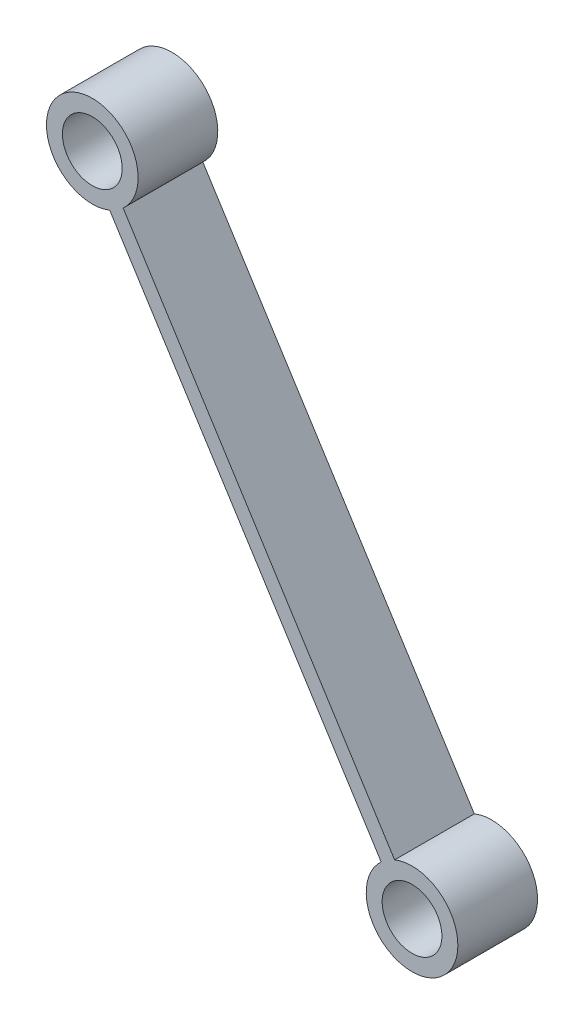
ISO-10303-21;
HEADER;
FILE_DESCRIPTION(('STEP AP214'),'2;1');
FILE_NAME('part.step','',(''),(''),'','','');
FILE_SCHEMA(('AUTOMOTIVE_DESIGN { 1 0 10303 214 1 1 1 1 }'));
ENDSEC;
DATA;
#1=APPLICATION_CONTEXT('core data for automotive mechanical design processes');
#2=APPLICATION_PROTOCOL_DEFINITION('international standard','automotive_design',2000,#1);
#3=PRODUCT_CONTEXT('',#1,'mechanical');
#4=PRODUCT('Part','Part','',(#3));
#5=PRODUCT_RELATED_PRODUCT_CATEGORY('part','',(#4));
#6=PRODUCT_DEFINITION_FORMATION('','',#4);
#7=PRODUCT_DEFINITION_CONTEXT('part definition',#1,'design');
#8=PRODUCT_DEFINITION('design','',#6,#7);
#9=PRODUCT_DEFINITION_SHAPE('','',#8);
#10=(LENGTH_UNIT() NAMED_UNIT(*) SI_UNIT(.MILLI.,.METRE.));
#11=(NAMED_UNIT(*) PLANE_ANGLE_UNIT() SI_UNIT($,.RADIAN.));
#12=(NAMED_UNIT(*) SI_UNIT($,.STERADIAN.) SOLID_ANGLE_UNIT());
#13=UNCERTAINTY_MEASURE_WITH_UNIT(LENGTH_MEASURE(1.E-05),#10,'distance_accuracy_value','');
#14=(GEOMETRIC_REPRESENTATION_CONTEXT(3) GLOBAL_UNCERTAINTY_ASSIGNED_CONTEXT((#13)) GLOBAL_UNIT_ASSIGNED_CONTEXT((#10,
#11,#12)) REPRESENTATION_CONTEXT('',''));
#15=CARTESIAN_POINT('',(0.,0.,0.));
#16=DIRECTION('',(0.,0.,1.));
#17=DIRECTION('',(1.,0.,0.));
#18=AXIS2_PLACEMENT_3D('',#15,#16,#17);
#19=CARTESIAN_POINT('',(-77.17683005113,-21.0650631914314,10.));
#20=DIRECTION('',(0.,0.,-1.));
#21=DIRECTION('',(-1.,0.,0.));
#22=AXIS2_PLACEMENT_3D('',#19,#20,#21);
#23=CYLINDRICAL_SURFACE('',#22,3.75000000000001);
#24=CARTESIAN_POINT('',(-77.17683005113,-21.0650631914314,0.));
#25=DIRECTION('',(0.,0.,1.));
#26=DIRECTION('',(1.,0.,0.));
#27=AXIS2_PLACEMENT_3D('',#24,#25,#26);
#28=CIRCLE('',#27,3.75000000000001);
#29=CARTESIAN_POINT('',(-73.42683005113,-21.0650631914314,0.));
#30=VERTEX_POINT('',#29);
#31=EDGE_CURVE('E11',#30,#30,#28,.T.);
#32=ORIENTED_EDGE('',*,*,#31,.F.);
#33=EDGE_LOOP('',(#32));
#34=FACE_BOUND('',#33,.T.);
#35=CARTESIAN_POINT('',(-77.17683005113,-21.0650631914314,10.));
#36=DIRECTION('',(0.,0.,1.));
#37=DIRECTION('',(1.,0.,0.));
#38=AXIS2_PLACEMENT_3D('',#35,#36,#37);
#39=CIRCLE('',#38,3.75000000000001);
#40=CARTESIAN_POINT('',(-73.42683005113,-21.0650631914314,10.));
#41=VERTEX_POINT('',#40);
#42=EDGE_CURVE('E39',#41,#41,#39,.T.);
#43=ORIENTED_EDGE('',*,*,#42,.T.);
#44=EDGE_LOOP('',(#43));
#45=FACE_BOUND('',#44,.T.);
#46=ADVANCED_FACE('F35',(#34,#45),#23,.F.);
#47=CARTESIAN_POINT('',(-78.2654756721996,-17.4765606190865,10.));
#48=DIRECTION('',(-0.844867509219085,-0.534975599318266,0.));
#49=DIRECTION('',(0.534975599318267,-0.844867509219086,0.));
#50=AXIS2_PLACEMENT_3D('',#47,#48,#49);
#51=PLANE('',#50);
#52=DIRECTION('',(-0.534975599318266,0.844867509219085,0.));
#53=VECTOR('',#52,1.);
#54=CARTESIAN_POINT('',(-78.2654756721996,-17.4765606190865,10.));
#55=LINE('',#54,#53);
#56=CARTESIAN_POINT('',(-79.3611954432329,-15.7461302313554,10.));
#57=VERTEX_POINT('',#56);
#58=CARTESIAN_POINT('',(-113.425899589459,38.0510182385605,10.));
#59=VERTEX_POINT('',#58);
#60=EDGE_CURVE('E52',#57,#59,#55,.T.);
#61=ORIENTED_EDGE('',*,*,#60,.F.);
#62=DIRECTION('',(0.,0.,1.));
#63=VECTOR('',#62,1.);
#64=CARTESIAN_POINT('',(-79.3611954432329,-15.7461302313554,0.));
#65=LINE('',#64,#63);
#66=CARTESIAN_POINT('',(-79.3611954432329,-15.7461302313554,0.));
#67=VERTEX_POINT('',#66);
#68=EDGE_CURVE('E85',#67,#57,#65,.T.);
#69=ORIENTED_EDGE('',*,*,#68,.F.);
#70=DIRECTION('',(-0.534975599318266,0.844867509219085,0.));
#71=VECTOR('',#70,1.);
#72=CARTESIAN_POINT('',(-78.2654756721996,-17.4765606190865,0.));
#73=LINE('',#72,#71);
#74=CARTESIAN_POINT('',(-113.425899589459,38.0510182385605,0.));
#75=VERTEX_POINT('',#74);
#76=EDGE_CURVE('E77',#67,#75,#73,.T.);
#77=ORIENTED_EDGE('',*,*,#76,.T.);
#78=DIRECTION('',(0.,0.,1.));
#79=VECTOR('',#78,1.);
#80=CARTESIAN_POINT('',(-113.425899589459,38.0510182385605,0.));
#81=LINE('',#80,#79);
#82=EDGE_CURVE('E104',#75,#59,#81,.T.);
#83=ORIENTED_EDGE('',*,*,#82,.T.);
#84=EDGE_LOOP('',(#61,#69,#77,#83));
#85=FACE_BOUND('',#84,.T.);
#86=ADVANCED_FACE('F86',(#85),#51,.F.);
#87=CARTESIAN_POINT('',(-117.3,42.3,10.));
#88=DIRECTION('',(0.,0.,-1.));
#89=DIRECTION('',(-1.,0.,0.));
#90=AXIS2_PLACEMENT_3D('',#87,#88,#89);
#91=CYLINDRICAL_SURFACE('',#90,3.75000000000001);
#92=CARTESIAN_POINT('',(-117.3,42.3,0.));
#93=DIRECTION('',(0.,0.,1.));
#94=DIRECTION('',(1.,0.,0.));
#95=AXIS2_PLACEMENT_3D('',#92,#93,#94);
#96=CIRCLE('',#95,3.75000000000001);
#97=CARTESIAN_POINT('',(-113.55,42.3,0.));
#98=VERTEX_POINT('',#97);
#99=EDGE_CURVE('E83',#98,#98,#96,.T.);
#100=ORIENTED_EDGE('',*,*,#99,.F.);
#101=EDGE_LOOP('',(#100));
#102=FACE_BOUND('',#101,.T.);
#103=CARTESIAN_POINT('',(-117.3,42.3,10.));
#104=DIRECTION('',(0.,0.,1.));
#105=DIRECTION('',(1.,0.,0.));
#106=AXIS2_PLACEMENT_3D('',#103,#104,#105);
#107=CIRCLE('',#106,3.75000000000001);
#108=CARTESIAN_POINT('',(-113.55,42.3,10.));
#109=VERTEX_POINT('',#108);
#110=EDGE_CURVE('E112',#109,#109,#107,.T.);
#111=ORIENTED_EDGE('',*,*,#110,.T.);
#112=EDGE_LOOP('',(#111));
#113=FACE_BOUND('',#112,.T.);
#114=ADVANCED_FACE('F131',(#102,#113),#91,.F.);
#115=CARTESIAN_POINT('',(-79.9552106906378,-18.5465118177231,10.));
#116=DIRECTION('',(-0.844867509219085,-0.534975599318266,0.));
#117=DIRECTION('',(0.534975599318267,-0.844867509219086,0.));
#118=AXIS2_PLACEMENT_3D('',#115,#116,#117);
#119=PLANE('',#118);
#120=DIRECTION('',(0.,0.,1.));
#121=VECTOR('',#120,1.);
#122=CARTESIAN_POINT('',(-81.0509304616711,-16.8160814299919,0.));
#123=LINE('',#122,#121);
#124=CARTESIAN_POINT('',(-81.0509304616711,-16.8160814299919,0.));
#125=VERTEX_POINT('',#124);
#126=CARTESIAN_POINT('',(-81.0509304616711,-16.8160814299919,10.));
#127=VERTEX_POINT('',#126);
#128=EDGE_CURVE('E90',#125,#127,#123,.T.);
#129=ORIENTED_EDGE('',*,*,#128,.T.);
#130=DIRECTION('',(-0.534975599318266,0.844867509219085,0.));
#131=VECTOR('',#130,1.);
#132=CARTESIAN_POINT('',(-79.9552106906378,-18.5465118177231,10.));
#133=LINE('',#132,#131);
#134=CARTESIAN_POINT('',(-115.115634607897,36.981067039924,10.));
#135=VERTEX_POINT('',#134);
#136=EDGE_CURVE('E114',#127,#135,#133,.T.);
#137=ORIENTED_EDGE('',*,*,#136,.T.);
#138=DIRECTION('',(0.,0.,1.));
#139=VECTOR('',#138,1.);
#140=CARTESIAN_POINT('',(-115.115634607897,36.981067039924,0.));
#141=LINE('',#140,#139);
#142=CARTESIAN_POINT('',(-115.115634607897,36.981067039924,0.));
#143=VERTEX_POINT('',#142);
#144=EDGE_CURVE('E101',#143,#135,#141,.T.);
#145=ORIENTED_EDGE('',*,*,#144,.F.);
#146=DIRECTION('',(-0.534975599318266,0.844867509219085,0.));
#147=VECTOR('',#146,1.);
#148=CARTESIAN_POINT('',(-79.9552106906378,-18.5465118177231,0.));
#149=LINE('',#148,#147);
#150=EDGE_CURVE('E44',#125,#143,#149,.T.);
#151=ORIENTED_EDGE('',*,*,#150,.F.);
#152=EDGE_LOOP('',(#129,#137,#145,#151));
#153=FACE_BOUND('',#152,.T.);
#154=ADVANCED_FACE('F123',(#153),#119,.T.);
#155=CARTESIAN_POINT('',(-77.17683005113,-21.0650631914314,10.));
#156=DIRECTION('',(0.,0.,1.));
#157=DIRECTION('',(1.,0.,0.));
#158=AXIS2_PLACEMENT_3D('',#155,#156,#157);
#159=PLANE('',#158);
#160=CARTESIAN_POINT('',(-77.17683005113,-21.0650631914314,10.));
#161=DIRECTION('',(0.,0.,1.));
#162=DIRECTION('',(1.,0.,0.));
#163=AXIS2_PLACEMENT_3D('',#160,#161,#162);
#164=CIRCLE('',#163,5.75000000000001);
#165=EDGE_CURVE('E95',#127,#57,#164,.T.);
#166=ORIENTED_EDGE('',*,*,#165,.T.);
#167=ORIENTED_EDGE('',*,*,#60,.T.);
#168=CARTESIAN_POINT('',(-117.3,42.3,10.));
#169=DIRECTION('',(0.,0.,1.));
#170=DIRECTION('',(1.,0.,0.));
#171=AXIS2_PLACEMENT_3D('',#168,#169,#170);
#172=CIRCLE('',#171,5.75000000000001);
#173=EDGE_CURVE('E89',#59,#135,#172,.T.);
#174=ORIENTED_EDGE('',*,*,#173,.T.);
#175=ORIENTED_EDGE('',*,*,#136,.F.);
#176=EDGE_LOOP('',(#166,#167,#174,#175));
#177=FACE_BOUND('',#176,.T.);
#178=ORIENTED_EDGE('',*,*,#110,.F.);
#179=EDGE_LOOP('',(#178));
#180=FACE_BOUND('',#179,.T.);
#181=ORIENTED_EDGE('',*,*,#42,.F.);
#182=EDGE_LOOP('',(#181));
#183=FACE_BOUND('',#182,.T.);
#184=ADVANCED_FACE('F37',(#177,#180,#183),#159,.T.);
#185=CARTESIAN_POINT('',(-77.17683005113,-21.0650631914314,0.));
#186=DIRECTION('',(0.,0.,1.));
#187=DIRECTION('',(1.,0.,0.));
#188=AXIS2_PLACEMENT_3D('',#185,#186,#187);
#189=PLANE('',#188);
#190=ORIENTED_EDGE('',*,*,#76,.F.);
#191=CARTESIAN_POINT('',(-77.17683005113,-21.0650631914314,0.));
#192=DIRECTION('',(0.,0.,1.));
#193=DIRECTION('',(1.,0.,0.));
#194=AXIS2_PLACEMENT_3D('',#191,#192,#193);
#195=CIRCLE('',#194,5.75000000000001);
#196=EDGE_CURVE('E60',#125,#67,#195,.T.);
#197=ORIENTED_EDGE('',*,*,#196,.F.);
#198=ORIENTED_EDGE('',*,*,#150,.T.);
#199=CARTESIAN_POINT('',(-117.3,42.3,0.));
#200=DIRECTION('',(0.,0.,1.));
#201=DIRECTION('',(1.,0.,0.));
#202=AXIS2_PLACEMENT_3D('',#199,#200,#201);
#203=CIRCLE('',#202,5.75000000000001);
#204=EDGE_CURVE('E81',#75,#143,#203,.T.);
#205=ORIENTED_EDGE('',*,*,#204,.F.);
#206=EDGE_LOOP('',(#190,#197,#198,#205));
#207=FACE_BOUND('',#206,.T.);
#208=ORIENTED_EDGE('',*,*,#99,.T.);
#209=EDGE_LOOP('',(#208));
#210=FACE_BOUND('',#209,.T.);
#211=ORIENTED_EDGE('',*,*,#31,.T.);
#212=EDGE_LOOP('',(#211));
#213=FACE_BOUND('',#212,.T.);
#214=ADVANCED_FACE('F78',(#207,#210,#213),#189,.F.);
#215=CARTESIAN_POINT('',(-117.3,42.3,0.));
#216=DIRECTION('',(0.,0.,1.));
#217=DIRECTION('',(1.,0.,0.));
#218=AXIS2_PLACEMENT_3D('',#215,#216,#217);
#219=CYLINDRICAL_SURFACE('',#218,5.75000000000001);
#220=ORIENTED_EDGE('',*,*,#173,.F.);
#221=ORIENTED_EDGE('',*,*,#82,.F.);
#222=ORIENTED_EDGE('',*,*,#204,.T.);
#223=ORIENTED_EDGE('',*,*,#144,.T.);
#224=EDGE_LOOP('',(#220,#221,#222,#223));
#225=FACE_BOUND('',#224,.T.);
#226=ADVANCED_FACE('F129',(#225),#219,.T.);
#227=CARTESIAN_POINT('',(-77.17683005113,-21.0650631914314,0.));
#228=DIRECTION('',(0.,0.,1.));
#229=DIRECTION('',(1.,0.,0.));
#230=AXIS2_PLACEMENT_3D('',#227,#228,#229);
#231=CYLINDRICAL_SURFACE('',#230,5.75000000000001);
#232=ORIENTED_EDGE('',*,*,#165,.F.);
#233=ORIENTED_EDGE('',*,*,#128,.F.);
#234=ORIENTED_EDGE('',*,*,#196,.T.);
#235=ORIENTED_EDGE('',*,*,#68,.T.);
#236=EDGE_LOOP('',(#232,#233,#234,#235));
#237=FACE_BOUND('',#236,.T.);
#238=ADVANCED_FACE('F92',(#237),#231,.T.);
#239=CLOSED_SHELL('',(#46,#86,#114,#154,#184,#214,#226,#238));
#240=MANIFOLD_SOLID_BREP('B2',#239);
#241=ADVANCED_BREP_SHAPE_REPRESENTATION('',(#18,#240),#14);
#242=SHAPE_DEFINITION_REPRESENTATION(#9,#241);
ENDSEC;
END-ISO-10303-21;
